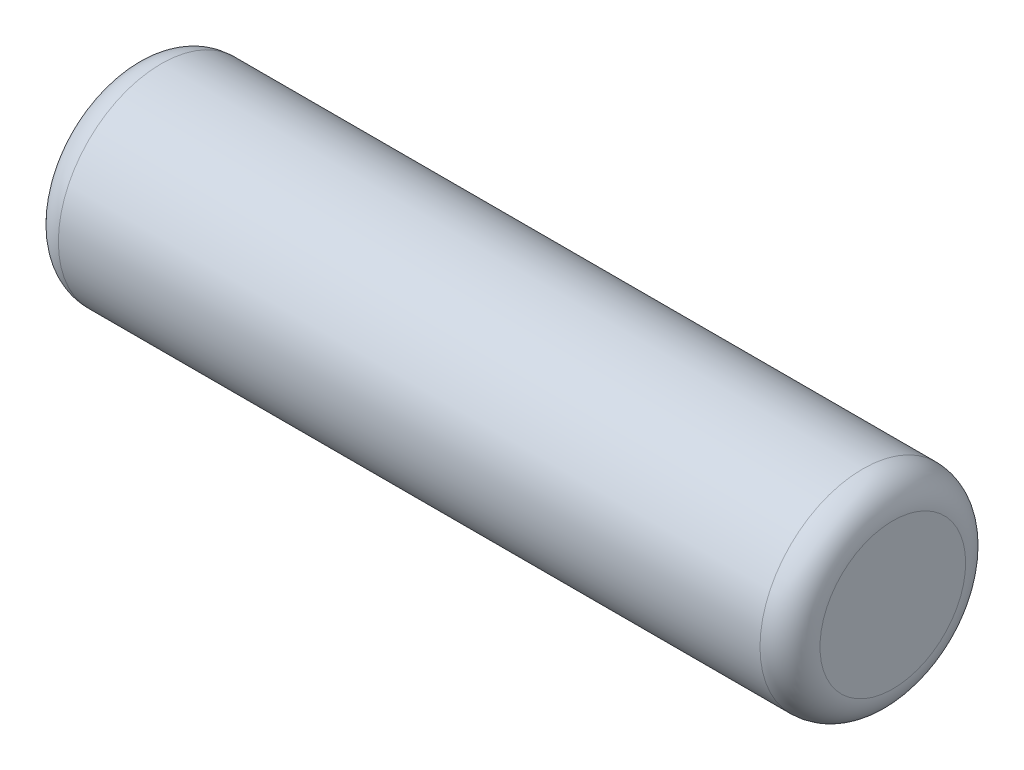
ISO-10303-21;
HEADER;
FILE_DESCRIPTION(('STEP AP214'),'2;1');
FILE_NAME('part.step','',(''),(''),'','','');
FILE_SCHEMA(('AUTOMOTIVE_DESIGN { 1 0 10303 214 1 1 1 1 }'));
ENDSEC;
DATA;
#1=APPLICATION_CONTEXT('core data for automotive mechanical design processes');
#2=APPLICATION_PROTOCOL_DEFINITION('international standard','automotive_design',2000,#1);
#3=PRODUCT_CONTEXT('',#1,'mechanical');
#4=PRODUCT('Part','Part','',(#3));
#5=PRODUCT_RELATED_PRODUCT_CATEGORY('part','',(#4));
#6=PRODUCT_DEFINITION_FORMATION('','',#4);
#7=PRODUCT_DEFINITION_CONTEXT('part definition',#1,'design');
#8=PRODUCT_DEFINITION('design','',#6,#7);
#9=PRODUCT_DEFINITION_SHAPE('','',#8);
#10=(LENGTH_UNIT() NAMED_UNIT(*) SI_UNIT(.MILLI.,.METRE.));
#11=(NAMED_UNIT(*) PLANE_ANGLE_UNIT() SI_UNIT($,.RADIAN.));
#12=(NAMED_UNIT(*) SI_UNIT($,.STERADIAN.) SOLID_ANGLE_UNIT());
#13=UNCERTAINTY_MEASURE_WITH_UNIT(LENGTH_MEASURE(1.E-05),#10,'distance_accuracy_value','');
#14=(GEOMETRIC_REPRESENTATION_CONTEXT(3) GLOBAL_UNCERTAINTY_ASSIGNED_CONTEXT((#13)) GLOBAL_UNIT_ASSIGNED_CONTEXT((#10,
#11,#12)) REPRESENTATION_CONTEXT('',''));
#15=CARTESIAN_POINT('',(0.,0.,0.));
#16=DIRECTION('',(0.,0.,1.));
#17=DIRECTION('',(1.,0.,0.));
#18=AXIS2_PLACEMENT_3D('',#15,#16,#17);
#19=CARTESIAN_POINT('',(7.62,-0.4858,1.3142));
#20=DIRECTION('',(1.,0.,0.));
#21=DIRECTION('',(0.,0.,-1.));
#22=AXIS2_PLACEMENT_3D('',#19,#20,#21);
#23=PLANE('',#22);
#24=CARTESIAN_POINT('',(7.62000000000001,0.,1.3142));
#25=DIRECTION('',(1.,0.,0.));
#26=DIRECTION('',(0.,0.,-1.));
#27=AXIS2_PLACEMENT_3D('',#24,#25,#26);
#28=CIRCLE('',#27,0.4858);
#29=CARTESIAN_POINT('',(7.62000000000001,0.,0.8284));
#30=VERTEX_POINT('',#29);
#31=EDGE_CURVE('E19',#30,#30,#28,.T.);
#32=ORIENTED_EDGE('',*,*,#31,.T.);
#33=EDGE_LOOP('',(#32));
#34=FACE_BOUND('',#33,.T.);
#35=ADVANCED_FACE('F15',(#34),#23,.T.);
#36=CARTESIAN_POINT('',(2.54,-0.4858,1.3142));
#37=DIRECTION('',(-1.,0.,0.));
#38=DIRECTION('',(0.,0.,1.));
#39=AXIS2_PLACEMENT_3D('',#36,#37,#38);
#40=PLANE('',#39);
#41=CARTESIAN_POINT('',(2.53999999999999,0.,1.3142));
#42=DIRECTION('',(-1.,0.,0.));
#43=DIRECTION('',(0.,0.,1.));
#44=AXIS2_PLACEMENT_3D('',#41,#42,#43);
#45=CIRCLE('',#44,0.4858);
#46=CARTESIAN_POINT('',(2.53999999999999,0.,1.8));
#47=VERTEX_POINT('',#46);
#48=EDGE_CURVE('E28',#47,#47,#45,.T.);
#49=ORIENTED_EDGE('',*,*,#48,.T.);
#50=EDGE_LOOP('',(#49));
#51=FACE_BOUND('',#50,.T.);
#52=ADVANCED_FACE('F40',(#51),#40,.T.);
#53=CARTESIAN_POINT('',(7.42,0.,1.3142));
#54=DIRECTION('',(1.,0.,0.));
#55=DIRECTION('',(0.,0.,-1.));
#56=AXIS2_PLACEMENT_3D('',#53,#54,#55);
#57=TOROIDAL_SURFACE('',#56,0.485799999999999,0.200000000000007);
#58=ORIENTED_EDGE('',*,*,#31,.F.);
#59=EDGE_LOOP('',(#58));
#60=FACE_BOUND('',#59,.T.);
#61=CARTESIAN_POINT('',(7.42,0.,1.3142));
#62=DIRECTION('',(1.,0.,0.));
#63=DIRECTION('',(0.,-1.,0.));
#64=AXIS2_PLACEMENT_3D('',#61,#62,#63);
#65=CIRCLE('',#64,0.6858);
#66=CARTESIAN_POINT('',(7.42,-0.6858,1.3142));
#67=VERTEX_POINT('',#66);
#68=EDGE_CURVE('E23',#67,#67,#65,.T.);
#69=ORIENTED_EDGE('',*,*,#68,.T.);
#70=EDGE_LOOP('',(#69));
#71=FACE_BOUND('',#70,.T.);
#72=ADVANCED_FACE('F37',(#60,#71),#57,.T.);
#73=CARTESIAN_POINT('',(2.74,0.,1.3142));
#74=DIRECTION('',(-1.,0.,0.));
#75=DIRECTION('',(0.,0.,1.));
#76=AXIS2_PLACEMENT_3D('',#73,#74,#75);
#77=TOROIDAL_SURFACE('',#76,0.4858,0.200000000000007);
#78=ORIENTED_EDGE('',*,*,#48,.F.);
#79=EDGE_LOOP('',(#78));
#80=FACE_BOUND('',#79,.T.);
#81=CARTESIAN_POINT('',(2.74,0.,1.3142));
#82=DIRECTION('',(1.,0.,0.));
#83=DIRECTION('',(0.,-1.,0.));
#84=AXIS2_PLACEMENT_3D('',#81,#82,#83);
#85=CIRCLE('',#84,0.6858);
#86=CARTESIAN_POINT('',(2.74,-0.6858,1.3142));
#87=VERTEX_POINT('',#86);
#88=EDGE_CURVE('E10',#87,#87,#85,.F.);
#89=ORIENTED_EDGE('',*,*,#88,.T.);
#90=EDGE_LOOP('',(#89));
#91=FACE_BOUND('',#90,.T.);
#92=ADVANCED_FACE('F17',(#80,#91),#77,.T.);
#93=CARTESIAN_POINT('',(7.42,0.,1.3142));
#94=DIRECTION('',(-1.,0.,0.));
#95=DIRECTION('',(0.,0.,1.));
#96=AXIS2_PLACEMENT_3D('',#93,#94,#95);
#97=CYLINDRICAL_SURFACE('',#96,0.6858);
#98=ORIENTED_EDGE('',*,*,#88,.F.);
#99=EDGE_LOOP('',(#98));
#100=FACE_BOUND('',#99,.T.);
#101=ORIENTED_EDGE('',*,*,#68,.F.);
#102=EDGE_LOOP('',(#101));
#103=FACE_BOUND('',#102,.T.);
#104=ADVANCED_FACE('F43',(#100,#103),#97,.T.);
#105=CLOSED_SHELL('',(#35,#52,#72,#92,#104));
#106=MANIFOLD_SOLID_BREP('B1',#105);
#107=ADVANCED_BREP_SHAPE_REPRESENTATION('',(#18,#106),#14);
#108=SHAPE_DEFINITION_REPRESENTATION(#9,#107);
ENDSEC;
END-ISO-10303-21;
